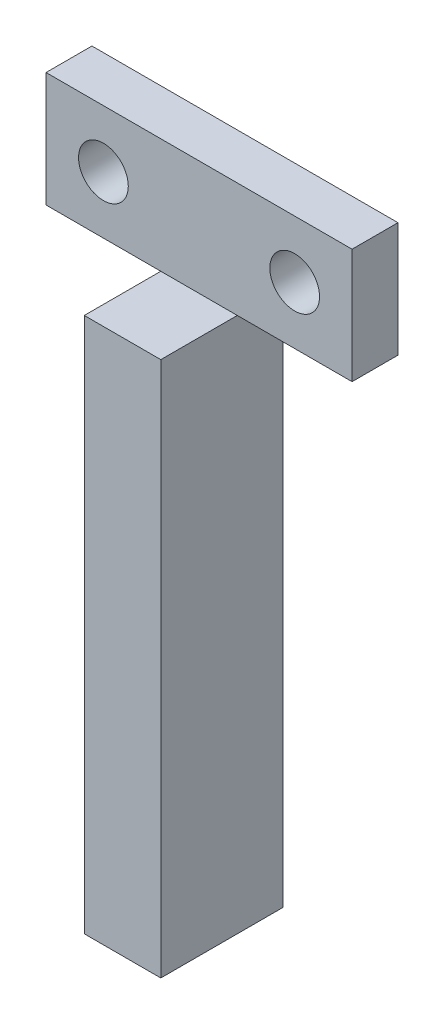
ISO-10303-21;
HEADER;
FILE_DESCRIPTION(('STEP AP214'),'2;1');
FILE_NAME('part.step','',(''),(''),'','','');
FILE_SCHEMA(('AUTOMOTIVE_DESIGN { 1 0 10303 214 1 1 1 1 }'));
ENDSEC;
DATA;
#1=APPLICATION_CONTEXT('core data for automotive mechanical design processes');
#2=APPLICATION_PROTOCOL_DEFINITION('international standard','automotive_design',2000,#1);
#3=PRODUCT_CONTEXT('',#1,'mechanical');
#4=PRODUCT('Part','Part','',(#3));
#5=PRODUCT_RELATED_PRODUCT_CATEGORY('part','',(#4));
#6=PRODUCT_DEFINITION_FORMATION('','',#4);
#7=PRODUCT_DEFINITION_CONTEXT('part definition',#1,'design');
#8=PRODUCT_DEFINITION('design','',#6,#7);
#9=PRODUCT_DEFINITION_SHAPE('','',#8);
#10=(LENGTH_UNIT() NAMED_UNIT(*) SI_UNIT(.MILLI.,.METRE.));
#11=(NAMED_UNIT(*) PLANE_ANGLE_UNIT() SI_UNIT($,.RADIAN.));
#12=(NAMED_UNIT(*) SI_UNIT($,.STERADIAN.) SOLID_ANGLE_UNIT());
#13=UNCERTAINTY_MEASURE_WITH_UNIT(LENGTH_MEASURE(1.E-05),#10,'distance_accuracy_value','');
#14=(GEOMETRIC_REPRESENTATION_CONTEXT(3) GLOBAL_UNCERTAINTY_ASSIGNED_CONTEXT((#13)) GLOBAL_UNIT_ASSIGNED_CONTEXT((#10,
#11,#12)) REPRESENTATION_CONTEXT('',''));
#15=CARTESIAN_POINT('',(0.,0.,0.));
#16=DIRECTION('',(0.,0.,1.));
#17=DIRECTION('',(1.,0.,0.));
#18=AXIS2_PLACEMENT_3D('',#15,#16,#17);
#19=CARTESIAN_POINT('',(0.,0.,3.));
#20=DIRECTION('',(0.,0.,-1.));
#21=DIRECTION('',(-1.,0.,0.));
#22=AXIS2_PLACEMENT_3D('',#19,#20,#21);
#23=PLANE('',#22);
#24=CARTESIAN_POINT('',(8.75,38.75,3.));
#25=DIRECTION('',(0.,0.,1.));
#26=DIRECTION('',(1.,0.,0.));
#27=AXIS2_PLACEMENT_3D('',#24,#25,#26);
#28=CIRCLE('',#27,1.625);
#29=CARTESIAN_POINT('',(10.375,38.75,3.));
#30=VERTEX_POINT('',#29);
#31=EDGE_CURVE('E198',#30,#30,#28,.T.);
#32=ORIENTED_EDGE('',*,*,#31,.F.);
#33=EDGE_LOOP('',(#32));
#34=FACE_BOUND('',#33,.T.);
#35=CARTESIAN_POINT('',(-3.75,38.75,3.));
#36=DIRECTION('',(0.,0.,1.));
#37=DIRECTION('',(1.,0.,0.));
#38=AXIS2_PLACEMENT_3D('',#35,#36,#37);
#39=CIRCLE('',#38,1.625);
#40=CARTESIAN_POINT('',(-2.125,38.75,3.));
#41=VERTEX_POINT('',#40);
#42=EDGE_CURVE('E142',#41,#41,#39,.T.);
#43=ORIENTED_EDGE('',*,*,#42,.F.);
#44=EDGE_LOOP('',(#43));
#45=FACE_BOUND('',#44,.T.);
#46=DIRECTION('',(-1.,0.,0.));
#47=VECTOR('',#46,1.);
#48=CARTESIAN_POINT('',(0.,35.,3.));
#49=LINE('',#48,#47);
#50=CARTESIAN_POINT('',(5.,35.,3.));
#51=VERTEX_POINT('',#50);
#52=CARTESIAN_POINT('',(0.,35.,3.));
#53=VERTEX_POINT('',#52);
#54=EDGE_CURVE('E99',#51,#53,#49,.T.);
#55=ORIENTED_EDGE('',*,*,#54,.F.);
#56=DIRECTION('',(1.,0.,0.));
#57=VECTOR('',#56,1.);
#58=CARTESIAN_POINT('',(12.5,35.,3.));
#59=LINE('',#58,#57);
#60=CARTESIAN_POINT('',(12.5,35.,3.));
#61=VERTEX_POINT('',#60);
#62=EDGE_CURVE('E111',#51,#61,#59,.T.);
#63=ORIENTED_EDGE('',*,*,#62,.T.);
#64=DIRECTION('',(0.,1.,0.));
#65=VECTOR('',#64,1.);
#66=CARTESIAN_POINT('',(12.5,42.5,3.));
#67=LINE('',#66,#65);
#68=CARTESIAN_POINT('',(12.5,42.5,3.));
#69=VERTEX_POINT('',#68);
#70=EDGE_CURVE('E107',#61,#69,#67,.T.);
#71=ORIENTED_EDGE('',*,*,#70,.T.);
#72=DIRECTION('',(-1.,0.,0.));
#73=VECTOR('',#72,1.);
#74=CARTESIAN_POINT('',(-7.5,42.5,3.));
#75=LINE('',#74,#73);
#76=CARTESIAN_POINT('',(-7.5,42.5,3.));
#77=VERTEX_POINT('',#76);
#78=EDGE_CURVE('E112',#69,#77,#75,.T.);
#79=ORIENTED_EDGE('',*,*,#78,.T.);
#80=DIRECTION('',(0.,-1.,0.));
#81=VECTOR('',#80,1.);
#82=CARTESIAN_POINT('',(-7.5,35.,3.));
#83=LINE('',#82,#81);
#84=CARTESIAN_POINT('',(-7.5,35.,3.));
#85=VERTEX_POINT('',#84);
#86=EDGE_CURVE('E57',#77,#85,#83,.T.);
#87=ORIENTED_EDGE('',*,*,#86,.T.);
#88=DIRECTION('',(1.,0.,0.));
#89=VECTOR('',#88,1.);
#90=CARTESIAN_POINT('',(0.,35.,3.));
#91=LINE('',#90,#89);
#92=EDGE_CURVE('E135',#85,#53,#91,.T.);
#93=ORIENTED_EDGE('',*,*,#92,.T.);
#94=EDGE_LOOP('',(#55,#63,#71,#79,#87,#93));
#95=FACE_BOUND('',#94,.T.);
#96=ADVANCED_FACE('F39',(#34,#45,#95),#23,.F.);
#97=CARTESIAN_POINT('',(0.,0.,0.));
#98=DIRECTION('',(0.,0.,-1.));
#99=DIRECTION('',(-1.,0.,0.));
#100=AXIS2_PLACEMENT_3D('',#97,#98,#99);
#101=PLANE('',#100);
#102=CARTESIAN_POINT('',(-3.75,38.75,0.));
#103=DIRECTION('',(0.,0.,1.));
#104=DIRECTION('',(1.,0.,0.));
#105=AXIS2_PLACEMENT_3D('',#102,#103,#104);
#106=CIRCLE('',#105,1.625);
#107=CARTESIAN_POINT('',(-2.125,38.75,0.));
#108=VERTEX_POINT('',#107);
#109=EDGE_CURVE('E200',#108,#108,#106,.T.);
#110=ORIENTED_EDGE('',*,*,#109,.T.);
#111=EDGE_LOOP('',(#110));
#112=FACE_BOUND('',#111,.T.);
#113=DIRECTION('',(1.,0.,0.));
#114=VECTOR('',#113,1.);
#115=CARTESIAN_POINT('',(5.,0.,0.));
#116=LINE('',#115,#114);
#117=CARTESIAN_POINT('',(0.,0.,0.));
#118=VERTEX_POINT('',#117);
#119=CARTESIAN_POINT('',(5.,0.,0.));
#120=VERTEX_POINT('',#119);
#121=EDGE_CURVE('E139',#118,#120,#116,.T.);
#122=ORIENTED_EDGE('',*,*,#121,.F.);
#123=DIRECTION('',(0.,-1.,0.));
#124=VECTOR('',#123,1.);
#125=CARTESIAN_POINT('',(0.,0.,0.));
#126=LINE('',#125,#124);
#127=CARTESIAN_POINT('',(0.,35.,0.));
#128=VERTEX_POINT('',#127);
#129=EDGE_CURVE('E91',#128,#118,#126,.T.);
#130=ORIENTED_EDGE('',*,*,#129,.F.);
#131=DIRECTION('',(1.,0.,0.));
#132=VECTOR('',#131,1.);
#133=CARTESIAN_POINT('',(0.,35.,0.));
#134=LINE('',#133,#132);
#135=CARTESIAN_POINT('',(-7.5,35.,0.));
#136=VERTEX_POINT('',#135);
#137=EDGE_CURVE('E88',#136,#128,#134,.T.);
#138=ORIENTED_EDGE('',*,*,#137,.F.);
#139=DIRECTION('',(0.,-1.,0.));
#140=VECTOR('',#139,1.);
#141=CARTESIAN_POINT('',(-7.5,35.,0.));
#142=LINE('',#141,#140);
#143=CARTESIAN_POINT('',(-7.5,42.5,0.));
#144=VERTEX_POINT('',#143);
#145=EDGE_CURVE('E149',#144,#136,#142,.T.);
#146=ORIENTED_EDGE('',*,*,#145,.F.);
#147=DIRECTION('',(-1.,0.,0.));
#148=VECTOR('',#147,1.);
#149=CARTESIAN_POINT('',(-7.5,42.5,0.));
#150=LINE('',#149,#148);
#151=CARTESIAN_POINT('',(12.5,42.5,0.));
#152=VERTEX_POINT('',#151);
#153=EDGE_CURVE('E150',#152,#144,#150,.T.);
#154=ORIENTED_EDGE('',*,*,#153,.F.);
#155=DIRECTION('',(0.,1.,0.));
#156=VECTOR('',#155,1.);
#157=CARTESIAN_POINT('',(12.5,42.5,0.));
#158=LINE('',#157,#156);
#159=CARTESIAN_POINT('',(12.5,35.,0.));
#160=VERTEX_POINT('',#159);
#161=EDGE_CURVE('E124',#160,#152,#158,.T.);
#162=ORIENTED_EDGE('',*,*,#161,.F.);
#163=DIRECTION('',(1.,0.,0.));
#164=VECTOR('',#163,1.);
#165=CARTESIAN_POINT('',(12.5,35.,0.));
#166=LINE('',#165,#164);
#167=CARTESIAN_POINT('',(5.,35.,0.));
#168=VERTEX_POINT('',#167);
#169=EDGE_CURVE('E145',#168,#160,#166,.T.);
#170=ORIENTED_EDGE('',*,*,#169,.F.);
#171=DIRECTION('',(0.,1.,0.));
#172=VECTOR('',#171,1.);
#173=CARTESIAN_POINT('',(5.,35.,0.));
#174=LINE('',#173,#172);
#175=EDGE_CURVE('E143',#120,#168,#174,.T.);
#176=ORIENTED_EDGE('',*,*,#175,.F.);
#177=EDGE_LOOP('',(#122,#130,#138,#146,#154,#162,#170,#176));
#178=FACE_BOUND('',#177,.T.);
#179=CARTESIAN_POINT('',(8.75,38.75,0.));
#180=DIRECTION('',(0.,0.,1.));
#181=DIRECTION('',(1.,0.,0.));
#182=AXIS2_PLACEMENT_3D('',#179,#180,#181);
#183=CIRCLE('',#182,1.625);
#184=CARTESIAN_POINT('',(10.375,38.75,0.));
#185=VERTEX_POINT('',#184);
#186=EDGE_CURVE('E189',#185,#185,#183,.T.);
#187=ORIENTED_EDGE('',*,*,#186,.T.);
#188=EDGE_LOOP('',(#187));
#189=FACE_BOUND('',#188,.T.);
#190=ADVANCED_FACE('F169',(#112,#178,#189),#101,.T.);
#191=CARTESIAN_POINT('',(5.,0.,3.));
#192=DIRECTION('',(0.,1.,0.));
#193=DIRECTION('',(0.,0.,1.));
#194=AXIS2_PLACEMENT_3D('',#191,#192,#193);
#195=PLANE('',#194);
#196=ORIENTED_EDGE('',*,*,#121,.T.);
#197=DIRECTION('',(0.,0.,-1.));
#198=VECTOR('',#197,1.);
#199=CARTESIAN_POINT('',(5.,0.,3.));
#200=LINE('',#199,#198);
#201=CARTESIAN_POINT('',(5.,0.,8.));
#202=VERTEX_POINT('',#201);
#203=EDGE_CURVE('E11',#202,#120,#200,.T.);
#204=ORIENTED_EDGE('',*,*,#203,.F.);
#205=DIRECTION('',(1.,0.,0.));
#206=VECTOR('',#205,1.);
#207=CARTESIAN_POINT('',(0.,0.,8.));
#208=LINE('',#207,#206);
#209=CARTESIAN_POINT('',(0.,0.,8.));
#210=VERTEX_POINT('',#209);
#211=EDGE_CURVE('E253',#210,#202,#208,.T.);
#212=ORIENTED_EDGE('',*,*,#211,.F.);
#213=DIRECTION('',(0.,0.,-1.));
#214=VECTOR('',#213,1.);
#215=CARTESIAN_POINT('',(0.,0.,3.));
#216=LINE('',#215,#214);
#217=EDGE_CURVE('E137',#210,#118,#216,.T.);
#218=ORIENTED_EDGE('',*,*,#217,.T.);
#219=EDGE_LOOP('',(#196,#204,#212,#218));
#220=FACE_BOUND('',#219,.T.);
#221=ADVANCED_FACE('F41',(#220),#195,.F.);
#222=CARTESIAN_POINT('',(5.,35.,3.));
#223=DIRECTION('',(-1.,0.,0.));
#224=DIRECTION('',(0.,-1.,0.));
#225=AXIS2_PLACEMENT_3D('',#222,#223,#224);
#226=PLANE('',#225);
#227=ORIENTED_EDGE('',*,*,#175,.T.);
#228=DIRECTION('',(0.,0.,-1.));
#229=VECTOR('',#228,1.);
#230=CARTESIAN_POINT('',(5.,35.,3.));
#231=LINE('',#230,#229);
#232=EDGE_CURVE('E48',#51,#168,#231,.T.);
#233=ORIENTED_EDGE('',*,*,#232,.F.);
#234=DIRECTION('',(0.,0.,-1.));
#235=VECTOR('',#234,1.);
#236=CARTESIAN_POINT('',(5.,35.,8.));
#237=LINE('',#236,#235);
#238=CARTESIAN_POINT('',(5.,35.,8.));
#239=VERTEX_POINT('',#238);
#240=EDGE_CURVE('E181',#239,#51,#237,.T.);
#241=ORIENTED_EDGE('',*,*,#240,.F.);
#242=DIRECTION('',(0.,1.,0.));
#243=VECTOR('',#242,1.);
#244=CARTESIAN_POINT('',(5.,35.,8.));
#245=LINE('',#244,#243);
#246=EDGE_CURVE('E194',#202,#239,#245,.T.);
#247=ORIENTED_EDGE('',*,*,#246,.F.);
#248=ORIENTED_EDGE('',*,*,#203,.T.);
#249=EDGE_LOOP('',(#227,#233,#241,#247,#248));
#250=FACE_BOUND('',#249,.T.);
#251=ADVANCED_FACE('F238',(#250),#226,.F.);
#252=CARTESIAN_POINT('',(12.5,35.,3.));
#253=DIRECTION('',(0.,1.,0.));
#254=DIRECTION('',(0.,0.,1.));
#255=AXIS2_PLACEMENT_3D('',#252,#253,#254);
#256=PLANE('',#255);
#257=ORIENTED_EDGE('',*,*,#169,.T.);
#258=DIRECTION('',(0.,0.,-1.));
#259=VECTOR('',#258,1.);
#260=CARTESIAN_POINT('',(12.5,35.,3.));
#261=LINE('',#260,#259);
#262=EDGE_CURVE('E127',#61,#160,#261,.T.);
#263=ORIENTED_EDGE('',*,*,#262,.F.);
#264=ORIENTED_EDGE('',*,*,#62,.F.);
#265=ORIENTED_EDGE('',*,*,#232,.T.);
#266=EDGE_LOOP('',(#257,#263,#264,#265));
#267=FACE_BOUND('',#266,.T.);
#268=ADVANCED_FACE('F165',(#267),#256,.F.);
#269=CARTESIAN_POINT('',(12.5,42.5,3.));
#270=DIRECTION('',(-1.,0.,0.));
#271=DIRECTION('',(0.,-1.,0.));
#272=AXIS2_PLACEMENT_3D('',#269,#270,#271);
#273=PLANE('',#272);
#274=ORIENTED_EDGE('',*,*,#161,.T.);
#275=DIRECTION('',(0.,0.,-1.));
#276=VECTOR('',#275,1.);
#277=CARTESIAN_POINT('',(12.5,42.5,3.));
#278=LINE('',#277,#276);
#279=EDGE_CURVE('E119',#69,#152,#278,.T.);
#280=ORIENTED_EDGE('',*,*,#279,.F.);
#281=ORIENTED_EDGE('',*,*,#70,.F.);
#282=ORIENTED_EDGE('',*,*,#262,.T.);
#283=EDGE_LOOP('',(#274,#280,#281,#282));
#284=FACE_BOUND('',#283,.T.);
#285=ADVANCED_FACE('F121',(#284),#273,.F.);
#286=CARTESIAN_POINT('',(-7.5,42.5,3.));
#287=DIRECTION('',(0.,-1.,0.));
#288=DIRECTION('',(0.,0.,-1.));
#289=AXIS2_PLACEMENT_3D('',#286,#287,#288);
#290=PLANE('',#289);
#291=ORIENTED_EDGE('',*,*,#153,.T.);
#292=DIRECTION('',(0.,0.,-1.));
#293=VECTOR('',#292,1.);
#294=CARTESIAN_POINT('',(-7.5,42.5,3.));
#295=LINE('',#294,#293);
#296=EDGE_CURVE('E130',#77,#144,#295,.T.);
#297=ORIENTED_EDGE('',*,*,#296,.F.);
#298=ORIENTED_EDGE('',*,*,#78,.F.);
#299=ORIENTED_EDGE('',*,*,#279,.T.);
#300=EDGE_LOOP('',(#291,#297,#298,#299));
#301=FACE_BOUND('',#300,.T.);
#302=ADVANCED_FACE('F129',(#301),#290,.F.);
#303=CARTESIAN_POINT('',(-7.5,35.,3.));
#304=DIRECTION('',(1.,0.,0.));
#305=DIRECTION('',(0.,0.,-1.));
#306=AXIS2_PLACEMENT_3D('',#303,#304,#305);
#307=PLANE('',#306);
#308=ORIENTED_EDGE('',*,*,#145,.T.);
#309=DIRECTION('',(0.,0.,-1.));
#310=VECTOR('',#309,1.);
#311=CARTESIAN_POINT('',(-7.5,35.,3.));
#312=LINE('',#311,#310);
#313=EDGE_CURVE('E156',#85,#136,#312,.T.);
#314=ORIENTED_EDGE('',*,*,#313,.F.);
#315=ORIENTED_EDGE('',*,*,#86,.F.);
#316=ORIENTED_EDGE('',*,*,#296,.T.);
#317=EDGE_LOOP('',(#308,#314,#315,#316));
#318=FACE_BOUND('',#317,.T.);
#319=ADVANCED_FACE('F175',(#318),#307,.F.);
#320=CARTESIAN_POINT('',(0.,35.,3.));
#321=DIRECTION('',(0.,1.,0.));
#322=DIRECTION('',(0.,0.,1.));
#323=AXIS2_PLACEMENT_3D('',#320,#321,#322);
#324=PLANE('',#323);
#325=ORIENTED_EDGE('',*,*,#137,.T.);
#326=DIRECTION('',(0.,0.,-1.));
#327=VECTOR('',#326,1.);
#328=CARTESIAN_POINT('',(0.,35.,3.));
#329=LINE('',#328,#327);
#330=EDGE_CURVE('E152',#53,#128,#329,.T.);
#331=ORIENTED_EDGE('',*,*,#330,.F.);
#332=ORIENTED_EDGE('',*,*,#92,.F.);
#333=ORIENTED_EDGE('',*,*,#313,.T.);
#334=EDGE_LOOP('',(#325,#331,#332,#333));
#335=FACE_BOUND('',#334,.T.);
#336=ADVANCED_FACE('F173',(#335),#324,.F.);
#337=CARTESIAN_POINT('',(0.,0.,3.));
#338=DIRECTION('',(1.,0.,0.));
#339=DIRECTION('',(0.,0.,-1.));
#340=AXIS2_PLACEMENT_3D('',#337,#338,#339);
#341=PLANE('',#340);
#342=ORIENTED_EDGE('',*,*,#129,.T.);
#343=ORIENTED_EDGE('',*,*,#217,.F.);
#344=DIRECTION('',(0.,-1.,0.));
#345=VECTOR('',#344,1.);
#346=CARTESIAN_POINT('',(0.,35.,8.));
#347=LINE('',#346,#345);
#348=CARTESIAN_POINT('',(0.,35.,8.));
#349=VERTEX_POINT('',#348);
#350=EDGE_CURVE('E184',#349,#210,#347,.T.);
#351=ORIENTED_EDGE('',*,*,#350,.F.);
#352=DIRECTION('',(0.,0.,-1.));
#353=VECTOR('',#352,1.);
#354=CARTESIAN_POINT('',(0.,35.,8.));
#355=LINE('',#354,#353);
#356=EDGE_CURVE('E182',#349,#53,#355,.T.);
#357=ORIENTED_EDGE('',*,*,#356,.T.);
#358=ORIENTED_EDGE('',*,*,#330,.T.);
#359=EDGE_LOOP('',(#342,#343,#351,#357,#358));
#360=FACE_BOUND('',#359,.T.);
#361=ADVANCED_FACE('F186',(#360),#341,.F.);
#362=CARTESIAN_POINT('',(-3.75,38.75,3.));
#363=DIRECTION('',(0.,0.,-1.));
#364=DIRECTION('',(-1.,0.,0.));
#365=AXIS2_PLACEMENT_3D('',#362,#363,#364);
#366=CYLINDRICAL_SURFACE('',#365,1.625);
#367=ORIENTED_EDGE('',*,*,#42,.T.);
#368=EDGE_LOOP('',(#367));
#369=FACE_BOUND('',#368,.T.);
#370=ORIENTED_EDGE('',*,*,#109,.F.);
#371=EDGE_LOOP('',(#370));
#372=FACE_BOUND('',#371,.T.);
#373=ADVANCED_FACE('F208',(#369,#372),#366,.F.);
#374=CARTESIAN_POINT('',(8.75,38.75,3.));
#375=DIRECTION('',(0.,0.,-1.));
#376=DIRECTION('',(-1.,0.,0.));
#377=AXIS2_PLACEMENT_3D('',#374,#375,#376);
#378=CYLINDRICAL_SURFACE('',#377,1.625);
#379=ORIENTED_EDGE('',*,*,#31,.T.);
#380=EDGE_LOOP('',(#379));
#381=FACE_BOUND('',#380,.T.);
#382=ORIENTED_EDGE('',*,*,#186,.F.);
#383=EDGE_LOOP('',(#382));
#384=FACE_BOUND('',#383,.T.);
#385=ADVANCED_FACE('F209',(#381,#384),#378,.F.);
#386=CARTESIAN_POINT('',(0.,35.,8.));
#387=DIRECTION('',(0.,-1.,0.));
#388=DIRECTION('',(0.,0.,-1.));
#389=AXIS2_PLACEMENT_3D('',#386,#387,#388);
#390=PLANE('',#389);
#391=ORIENTED_EDGE('',*,*,#54,.T.);
#392=ORIENTED_EDGE('',*,*,#356,.F.);
#393=DIRECTION('',(-1.,0.,0.));
#394=VECTOR('',#393,1.);
#395=CARTESIAN_POINT('',(0.,35.,8.));
#396=LINE('',#395,#394);
#397=EDGE_CURVE('E187',#239,#349,#396,.T.);
#398=ORIENTED_EDGE('',*,*,#397,.F.);
#399=ORIENTED_EDGE('',*,*,#240,.T.);
#400=EDGE_LOOP('',(#391,#392,#398,#399));
#401=FACE_BOUND('',#400,.T.);
#402=ADVANCED_FACE('F178',(#401),#390,.F.);
#403=CARTESIAN_POINT('',(0.,0.,8.));
#404=DIRECTION('',(0.,0.,1.));
#405=DIRECTION('',(1.,0.,0.));
#406=AXIS2_PLACEMENT_3D('',#403,#404,#405);
#407=PLANE('',#406);
#408=ORIENTED_EDGE('',*,*,#350,.T.);
#409=ORIENTED_EDGE('',*,*,#211,.T.);
#410=ORIENTED_EDGE('',*,*,#246,.T.);
#411=ORIENTED_EDGE('',*,*,#397,.T.);
#412=EDGE_LOOP('',(#408,#409,#410,#411));
#413=FACE_BOUND('',#412,.T.);
#414=ADVANCED_FACE('F260',(#413),#407,.T.);
#415=CLOSED_SHELL('',(#96,#190,#221,#251,#268,#285,#302,#319,#336,#361,#373,#385,#402,#414));
#416=MANIFOLD_SOLID_BREP('B2',#415);
#417=ADVANCED_BREP_SHAPE_REPRESENTATION('',(#18,#416),#14);
#418=SHAPE_DEFINITION_REPRESENTATION(#9,#417);
ENDSEC;
END-ISO-10303-21;
